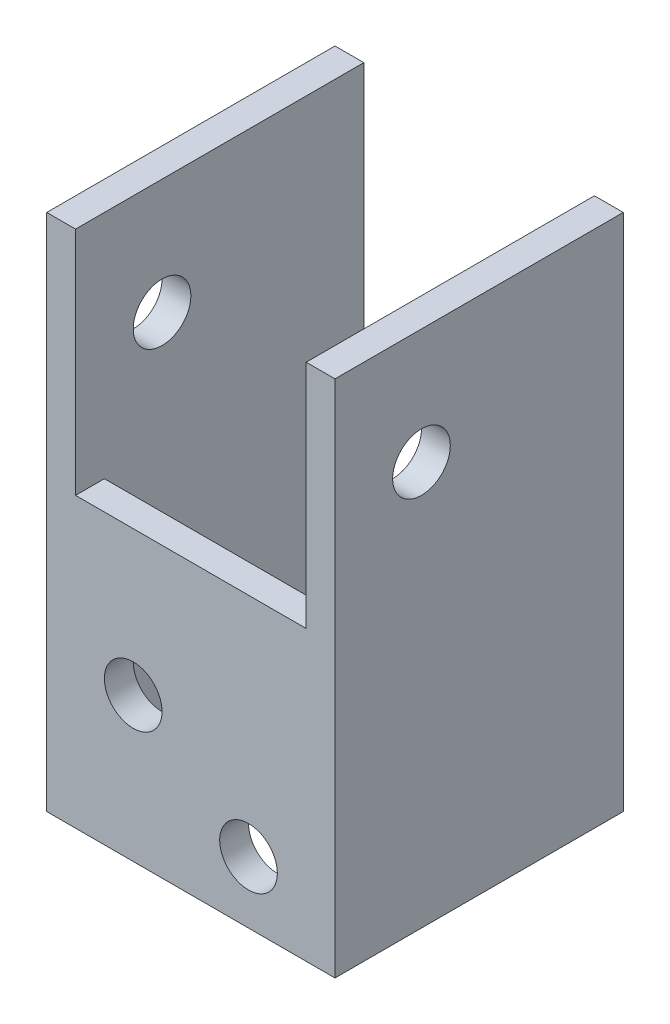
ISO-10303-21;
HEADER;
FILE_DESCRIPTION(('STEP AP214'),'2;1');
FILE_NAME('part.step','',(''),(''),'','','');
FILE_SCHEMA(('AUTOMOTIVE_DESIGN { 1 0 10303 214 1 1 1 1 }'));
ENDSEC;
DATA;
#1=APPLICATION_CONTEXT('core data for automotive mechanical design processes');
#2=APPLICATION_PROTOCOL_DEFINITION('international standard','automotive_design',2000,#1);
#3=PRODUCT_CONTEXT('',#1,'mechanical');
#4=PRODUCT('Part','Part','',(#3));
#5=PRODUCT_RELATED_PRODUCT_CATEGORY('part','',(#4));
#6=PRODUCT_DEFINITION_FORMATION('','',#4);
#7=PRODUCT_DEFINITION_CONTEXT('part definition',#1,'design');
#8=PRODUCT_DEFINITION('design','',#6,#7);
#9=PRODUCT_DEFINITION_SHAPE('','',#8);
#10=(LENGTH_UNIT() NAMED_UNIT(*) SI_UNIT(.MILLI.,.METRE.));
#11=(NAMED_UNIT(*) PLANE_ANGLE_UNIT() SI_UNIT($,.RADIAN.));
#12=(NAMED_UNIT(*) SI_UNIT($,.STERADIAN.) SOLID_ANGLE_UNIT());
#13=UNCERTAINTY_MEASURE_WITH_UNIT(LENGTH_MEASURE(1.E-05),#10,'distance_accuracy_value','');
#14=(GEOMETRIC_REPRESENTATION_CONTEXT(3) GLOBAL_UNCERTAINTY_ASSIGNED_CONTEXT((#13)) GLOBAL_UNIT_ASSIGNED_CONTEXT((#10,
#11,#12)) REPRESENTATION_CONTEXT('',''));
#15=CARTESIAN_POINT('',(0.,0.,0.));
#16=DIRECTION('',(0.,0.,1.));
#17=DIRECTION('',(1.,0.,0.));
#18=AXIS2_PLACEMENT_3D('',#15,#16,#17);
#19=CARTESIAN_POINT('',(0.,57.15,0.));
#20=DIRECTION('',(0.,-1.,0.));
#21=DIRECTION('',(0.,0.,-1.));
#22=AXIS2_PLACEMENT_3D('',#19,#20,#21);
#23=PLANE('',#22);
#24=DIRECTION('',(0.,0.,-1.));
#25=VECTOR('',#24,1.);
#26=CARTESIAN_POINT('',(28.575,57.15,-3.175));
#27=LINE('',#26,#25);
#28=CARTESIAN_POINT('',(28.575,57.15,0.));
#29=VERTEX_POINT('',#28);
#30=CARTESIAN_POINT('',(28.575,57.15,-31.75));
#31=VERTEX_POINT('',#30);
#32=EDGE_CURVE('E124',#29,#31,#27,.T.);
#33=ORIENTED_EDGE('',*,*,#32,.F.);
#34=DIRECTION('',(1.,0.,0.));
#35=VECTOR('',#34,1.);
#36=CARTESIAN_POINT('',(0.,57.15,0.));
#37=LINE('',#36,#35);
#38=CARTESIAN_POINT('',(31.75,57.15,0.));
#39=VERTEX_POINT('',#38);
#40=EDGE_CURVE('E127',#29,#39,#37,.T.);
#41=ORIENTED_EDGE('',*,*,#40,.T.);
#42=DIRECTION('',(0.,0.,-1.));
#43=VECTOR('',#42,1.);
#44=CARTESIAN_POINT('',(31.75,57.15,0.));
#45=LINE('',#44,#43);
#46=CARTESIAN_POINT('',(31.75,57.15,-31.75));
#47=VERTEX_POINT('',#46);
#48=EDGE_CURVE('E155',#39,#47,#45,.T.);
#49=ORIENTED_EDGE('',*,*,#48,.T.);
#50=DIRECTION('',(-1.,0.,0.));
#51=VECTOR('',#50,1.);
#52=CARTESIAN_POINT('',(0.,57.15,-31.75));
#53=LINE('',#52,#51);
#54=EDGE_CURVE('E130',#47,#31,#53,.T.);
#55=ORIENTED_EDGE('',*,*,#54,.T.);
#56=EDGE_LOOP('',(#33,#41,#49,#55));
#57=FACE_BOUND('',#56,.T.);
#58=ADVANCED_FACE('F47',(#57),#23,.F.);
#59=CARTESIAN_POINT('',(0.,57.15,-31.75));
#60=DIRECTION('',(0.,0.,1.));
#61=DIRECTION('',(1.,0.,0.));
#62=AXIS2_PLACEMENT_3D('',#59,#60,#61);
#63=PLANE('',#62);
#64=DIRECTION('',(-1.,0.,0.));
#65=VECTOR('',#64,1.);
#66=CARTESIAN_POINT('',(0.,0.,-31.75));
#67=LINE('',#66,#65);
#68=CARTESIAN_POINT('',(31.75,0.,-31.75));
#69=VERTEX_POINT('',#68);
#70=CARTESIAN_POINT('',(28.575,0.,-31.75));
#71=VERTEX_POINT('',#70);
#72=EDGE_CURVE('E157',#69,#71,#67,.T.);
#73=ORIENTED_EDGE('',*,*,#72,.T.);
#74=DIRECTION('',(0.,-1.,0.));
#75=VECTOR('',#74,1.);
#76=CARTESIAN_POINT('',(28.575,0.,-31.75));
#77=LINE('',#76,#75);
#78=EDGE_CURVE('E188',#31,#71,#77,.T.);
#79=ORIENTED_EDGE('',*,*,#78,.F.);
#80=ORIENTED_EDGE('',*,*,#54,.F.);
#81=DIRECTION('',(0.,-1.,0.));
#82=VECTOR('',#81,1.);
#83=CARTESIAN_POINT('',(31.75,57.15,-31.75));
#84=LINE('',#83,#82);
#85=EDGE_CURVE('E178',#47,#69,#84,.T.);
#86=ORIENTED_EDGE('',*,*,#85,.T.);
#87=EDGE_LOOP('',(#73,#79,#80,#86));
#88=FACE_BOUND('',#87,.T.);
#89=ADVANCED_FACE('F267',(#88),#63,.F.);
#90=CARTESIAN_POINT('',(0.,57.15,0.));
#91=VERTEX_POINT('',#90);
#92=CARTESIAN_POINT('',(3.175,57.15,0.));
#93=VERTEX_POINT('',#92);
#94=EDGE_CURVE('E151',#91,#93,#37,.T.);
#95=ORIENTED_EDGE('',*,*,#94,.T.);
#96=DIRECTION('',(0.,0.,1.));
#97=VECTOR('',#96,1.);
#98=CARTESIAN_POINT('',(3.175,57.15,-3.175));
#99=LINE('',#98,#97);
#100=CARTESIAN_POINT('',(3.175,57.15,-31.75));
#101=VERTEX_POINT('',#100);
#102=EDGE_CURVE('E134',#101,#93,#99,.T.);
#103=ORIENTED_EDGE('',*,*,#102,.F.);
#104=CARTESIAN_POINT('',(0.,57.15,-31.75));
#105=VERTEX_POINT('',#104);
#106=EDGE_CURVE('E162',#101,#105,#53,.T.);
#107=ORIENTED_EDGE('',*,*,#106,.T.);
#108=DIRECTION('',(0.,0.,1.));
#109=VECTOR('',#108,1.);
#110=CARTESIAN_POINT('',(0.,57.15,0.));
#111=LINE('',#110,#109);
#112=EDGE_CURVE('E152',#105,#91,#111,.T.);
#113=ORIENTED_EDGE('',*,*,#112,.T.);
#114=EDGE_LOOP('',(#95,#103,#107,#113));
#115=FACE_BOUND('',#114,.T.);
#116=ADVANCED_FACE('F240',(#115),#23,.F.);
#117=CARTESIAN_POINT('',(0.,0.,0.));
#118=DIRECTION('',(0.,-1.,0.));
#119=DIRECTION('',(0.,0.,-1.));
#120=AXIS2_PLACEMENT_3D('',#117,#118,#119);
#121=PLANE('',#120);
#122=DIRECTION('',(0.,0.,-1.));
#123=VECTOR('',#122,1.);
#124=CARTESIAN_POINT('',(28.575,0.,-3.175));
#125=LINE('',#124,#123);
#126=CARTESIAN_POINT('',(28.575,0.,-3.175));
#127=VERTEX_POINT('',#126);
#128=EDGE_CURVE('E216',#127,#71,#125,.T.);
#129=ORIENTED_EDGE('',*,*,#128,.T.);
#130=ORIENTED_EDGE('',*,*,#72,.F.);
#131=DIRECTION('',(0.,0.,-1.));
#132=VECTOR('',#131,1.);
#133=CARTESIAN_POINT('',(31.75,0.,0.));
#134=LINE('',#133,#132);
#135=CARTESIAN_POINT('',(31.75,0.,0.));
#136=VERTEX_POINT('',#135);
#137=EDGE_CURVE('E171',#136,#69,#134,.T.);
#138=ORIENTED_EDGE('',*,*,#137,.F.);
#139=DIRECTION('',(1.,0.,0.));
#140=VECTOR('',#139,1.);
#141=CARTESIAN_POINT('',(0.,0.,0.));
#142=LINE('',#141,#140);
#143=CARTESIAN_POINT('',(0.,0.,0.));
#144=VERTEX_POINT('',#143);
#145=EDGE_CURVE('E168',#144,#136,#142,.T.);
#146=ORIENTED_EDGE('',*,*,#145,.F.);
#147=DIRECTION('',(0.,0.,1.));
#148=VECTOR('',#147,1.);
#149=CARTESIAN_POINT('',(0.,0.,0.));
#150=LINE('',#149,#148);
#151=CARTESIAN_POINT('',(0.,0.,-31.75));
#152=VERTEX_POINT('',#151);
#153=EDGE_CURVE('E165',#152,#144,#150,.T.);
#154=ORIENTED_EDGE('',*,*,#153,.F.);
#155=CARTESIAN_POINT('',(3.17499999999999,0.,-31.75));
#156=VERTEX_POINT('',#155);
#157=EDGE_CURVE('E173',#156,#152,#67,.T.);
#158=ORIENTED_EDGE('',*,*,#157,.F.);
#159=DIRECTION('',(0.,0.,1.));
#160=VECTOR('',#159,1.);
#161=CARTESIAN_POINT('',(3.175,0.,-3.175));
#162=LINE('',#161,#160);
#163=CARTESIAN_POINT('',(3.175,0.,-3.175));
#164=VERTEX_POINT('',#163);
#165=EDGE_CURVE('E135',#156,#164,#162,.T.);
#166=ORIENTED_EDGE('',*,*,#165,.T.);
#167=DIRECTION('',(1.,0.,0.));
#168=VECTOR('',#167,1.);
#169=CARTESIAN_POINT('',(3.175,0.,-3.175));
#170=LINE('',#169,#168);
#171=EDGE_CURVE('E211',#164,#127,#170,.T.);
#172=ORIENTED_EDGE('',*,*,#171,.T.);
#173=EDGE_LOOP('',(#129,#130,#138,#146,#154,#158,#166,#172));
#174=FACE_BOUND('',#173,.T.);
#175=ADVANCED_FACE('F228',(#174),#121,.T.);
#176=CARTESIAN_POINT('',(0.,57.15,0.));
#177=DIRECTION('',(1.,0.,0.));
#178=DIRECTION('',(0.,0.,-1.));
#179=AXIS2_PLACEMENT_3D('',#176,#177,#178);
#180=PLANE('',#179);
#181=CARTESIAN_POINT('',(0.,44.45,-9.525));
#182=DIRECTION('',(1.,0.,0.));
#183=DIRECTION('',(0.,0.,-1.));
#184=AXIS2_PLACEMENT_3D('',#181,#182,#183);
#185=CIRCLE('',#184,3.17499999999999);
#186=CARTESIAN_POINT('',(0.,44.45,-12.7));
#187=VERTEX_POINT('',#186);
#188=EDGE_CURVE('E185',#187,#187,#185,.T.);
#189=ORIENTED_EDGE('',*,*,#188,.T.);
#190=EDGE_LOOP('',(#189));
#191=FACE_BOUND('',#190,.T.);
#192=ORIENTED_EDGE('',*,*,#153,.T.);
#193=DIRECTION('',(0.,-1.,0.));
#194=VECTOR('',#193,1.);
#195=CARTESIAN_POINT('',(0.,57.15,0.));
#196=LINE('',#195,#194);
#197=EDGE_CURVE('E11',#91,#144,#196,.T.);
#198=ORIENTED_EDGE('',*,*,#197,.F.);
#199=ORIENTED_EDGE('',*,*,#112,.F.);
#200=DIRECTION('',(0.,-1.,0.));
#201=VECTOR('',#200,1.);
#202=CARTESIAN_POINT('',(0.,57.15,-31.75));
#203=LINE('',#202,#201);
#204=EDGE_CURVE('E164',#105,#152,#203,.T.);
#205=ORIENTED_EDGE('',*,*,#204,.T.);
#206=EDGE_LOOP('',(#192,#198,#199,#205));
#207=FACE_BOUND('',#206,.T.);
#208=ADVANCED_FACE('F49',(#191,#207),#180,.F.);
#209=CARTESIAN_POINT('',(0.,57.15,0.));
#210=DIRECTION('',(0.,0.,-1.));
#211=DIRECTION('',(-1.,0.,0.));
#212=AXIS2_PLACEMENT_3D('',#209,#210,#211);
#213=PLANE('',#212);
#214=CARTESIAN_POINT('',(22.225,6.80357142857142,0.));
#215=DIRECTION('',(0.,0.,1.));
#216=DIRECTION('',(1.,0.,0.));
#217=AXIS2_PLACEMENT_3D('',#214,#215,#216);
#218=CIRCLE('',#217,3.175);
#219=CARTESIAN_POINT('',(25.4,6.80357142857142,0.));
#220=VERTEX_POINT('',#219);
#221=EDGE_CURVE('E199',#220,#220,#218,.T.);
#222=ORIENTED_EDGE('',*,*,#221,.F.);
#223=EDGE_LOOP('',(#222));
#224=FACE_BOUND('',#223,.T.);
#225=CARTESIAN_POINT('',(9.525,15.875,0.));
#226=DIRECTION('',(0.,0.,1.));
#227=DIRECTION('',(1.,0.,0.));
#228=AXIS2_PLACEMENT_3D('',#225,#226,#227);
#229=CIRCLE('',#228,3.175);
#230=CARTESIAN_POINT('',(12.7,15.875,0.));
#231=VERTEX_POINT('',#230);
#232=EDGE_CURVE('E189',#231,#231,#229,.T.);
#233=ORIENTED_EDGE('',*,*,#232,.F.);
#234=EDGE_LOOP('',(#233));
#235=FACE_BOUND('',#234,.T.);
#236=ORIENTED_EDGE('',*,*,#40,.F.);
#237=DIRECTION('',(0.,1.,0.));
#238=VECTOR('',#237,1.);
#239=CARTESIAN_POINT('',(28.575,57.15,0.));
#240=LINE('',#239,#238);
#241=CARTESIAN_POINT('',(28.575,31.75,0.));
#242=VERTEX_POINT('',#241);
#243=EDGE_CURVE('E138',#242,#29,#240,.T.);
#244=ORIENTED_EDGE('',*,*,#243,.F.);
#245=DIRECTION('',(1.,0.,0.));
#246=VECTOR('',#245,1.);
#247=CARTESIAN_POINT('',(28.575,31.75,0.));
#248=LINE('',#247,#246);
#249=CARTESIAN_POINT('',(3.175,31.75,0.));
#250=VERTEX_POINT('',#249);
#251=EDGE_CURVE('E243',#250,#242,#248,.T.);
#252=ORIENTED_EDGE('',*,*,#251,.F.);
#253=DIRECTION('',(0.,-1.,0.));
#254=VECTOR('',#253,1.);
#255=CARTESIAN_POINT('',(3.175,31.75,0.));
#256=LINE('',#255,#254);
#257=EDGE_CURVE('E146',#93,#250,#256,.T.);
#258=ORIENTED_EDGE('',*,*,#257,.F.);
#259=ORIENTED_EDGE('',*,*,#94,.F.);
#260=ORIENTED_EDGE('',*,*,#197,.T.);
#261=ORIENTED_EDGE('',*,*,#145,.T.);
#262=DIRECTION('',(0.,-1.,0.));
#263=VECTOR('',#262,1.);
#264=CARTESIAN_POINT('',(31.75,57.15,0.));
#265=LINE('',#264,#263);
#266=EDGE_CURVE('E56',#39,#136,#265,.T.);
#267=ORIENTED_EDGE('',*,*,#266,.F.);
#268=EDGE_LOOP('',(#236,#244,#252,#258,#259,#260,#261,#267));
#269=FACE_BOUND('',#268,.T.);
#270=ADVANCED_FACE('F148',(#224,#235,#269),#213,.F.);
#271=CARTESIAN_POINT('',(31.75,57.15,0.));
#272=DIRECTION('',(-1.,0.,0.));
#273=DIRECTION('',(0.,0.,1.));
#274=AXIS2_PLACEMENT_3D('',#271,#272,#273);
#275=PLANE('',#274);
#276=CARTESIAN_POINT('',(31.75,44.45,-9.525));
#277=DIRECTION('',(1.,0.,0.));
#278=DIRECTION('',(0.,0.,-1.));
#279=AXIS2_PLACEMENT_3D('',#276,#277,#278);
#280=CIRCLE('',#279,3.175);
#281=CARTESIAN_POINT('',(31.75,44.45,-12.7));
#282=VERTEX_POINT('',#281);
#283=EDGE_CURVE('E205',#282,#282,#280,.T.);
#284=ORIENTED_EDGE('',*,*,#283,.F.);
#285=EDGE_LOOP('',(#284));
#286=FACE_BOUND('',#285,.T.);
#287=ORIENTED_EDGE('',*,*,#137,.T.);
#288=ORIENTED_EDGE('',*,*,#85,.F.);
#289=ORIENTED_EDGE('',*,*,#48,.F.);
#290=ORIENTED_EDGE('',*,*,#266,.T.);
#291=EDGE_LOOP('',(#287,#288,#289,#290));
#292=FACE_BOUND('',#291,.T.);
#293=ADVANCED_FACE('F256',(#286,#292),#275,.F.);
#294=ORIENTED_EDGE('',*,*,#106,.F.);
#295=DIRECTION('',(0.,1.,0.));
#296=VECTOR('',#295,1.);
#297=CARTESIAN_POINT('',(3.175,57.15,-31.75));
#298=LINE('',#297,#296);
#299=EDGE_CURVE('E192',#156,#101,#298,.T.);
#300=ORIENTED_EDGE('',*,*,#299,.F.);
#301=ORIENTED_EDGE('',*,*,#157,.T.);
#302=ORIENTED_EDGE('',*,*,#204,.F.);
#303=EDGE_LOOP('',(#294,#300,#301,#302));
#304=FACE_BOUND('',#303,.T.);
#305=ADVANCED_FACE('F236',(#304),#63,.F.);
#306=CARTESIAN_POINT('',(3.175,57.15,-3.175));
#307=DIRECTION('',(0.,0.,-1.));
#308=DIRECTION('',(-1.,0.,0.));
#309=AXIS2_PLACEMENT_3D('',#306,#307,#308);
#310=PLANE('',#309);
#311=DIRECTION('',(-1.,0.,0.));
#312=VECTOR('',#311,1.);
#313=CARTESIAN_POINT('',(3.175,31.75,-3.175));
#314=LINE('',#313,#312);
#315=CARTESIAN_POINT('',(28.575,31.75,-3.175));
#316=VERTEX_POINT('',#315);
#317=CARTESIAN_POINT('',(3.175,31.75,-3.175));
#318=VERTEX_POINT('',#317);
#319=EDGE_CURVE('E225',#316,#318,#314,.T.);
#320=ORIENTED_EDGE('',*,*,#319,.F.);
#321=DIRECTION('',(0.,-1.,0.));
#322=VECTOR('',#321,1.);
#323=CARTESIAN_POINT('',(28.575,57.15,-3.175));
#324=LINE('',#323,#322);
#325=EDGE_CURVE('E169',#316,#127,#324,.T.);
#326=ORIENTED_EDGE('',*,*,#325,.T.);
#327=ORIENTED_EDGE('',*,*,#171,.F.);
#328=DIRECTION('',(0.,-1.,0.));
#329=VECTOR('',#328,1.);
#330=CARTESIAN_POINT('',(3.175,57.15,-3.175));
#331=LINE('',#330,#329);
#332=EDGE_CURVE('E69',#318,#164,#331,.T.);
#333=ORIENTED_EDGE('',*,*,#332,.F.);
#334=EDGE_LOOP('',(#320,#326,#327,#333));
#335=FACE_BOUND('',#334,.T.);
#336=CARTESIAN_POINT('',(22.225,6.80357142857142,-3.175));
#337=DIRECTION('',(0.,0.,-1.));
#338=DIRECTION('',(-1.,0.,0.));
#339=AXIS2_PLACEMENT_3D('',#336,#337,#338);
#340=CIRCLE('',#339,3.17499999999999);
#341=CARTESIAN_POINT('',(19.05,6.80357142857142,-3.175));
#342=VERTEX_POINT('',#341);
#343=EDGE_CURVE('E51',#342,#342,#340,.T.);
#344=ORIENTED_EDGE('',*,*,#343,.F.);
#345=EDGE_LOOP('',(#344));
#346=FACE_BOUND('',#345,.T.);
#347=CARTESIAN_POINT('',(9.525,15.875,-3.175));
#348=DIRECTION('',(0.,0.,-1.));
#349=DIRECTION('',(-1.,0.,0.));
#350=AXIS2_PLACEMENT_3D('',#347,#348,#349);
#351=CIRCLE('',#350,3.17499999999999);
#352=CARTESIAN_POINT('',(6.35000000000001,15.875,-3.175));
#353=VERTEX_POINT('',#352);
#354=EDGE_CURVE('E186',#353,#353,#351,.T.);
#355=ORIENTED_EDGE('',*,*,#354,.F.);
#356=EDGE_LOOP('',(#355));
#357=FACE_BOUND('',#356,.T.);
#358=ADVANCED_FACE('F223',(#335,#346,#357),#310,.T.);
#359=CARTESIAN_POINT('',(28.575,57.15,-3.175));
#360=DIRECTION('',(-1.,0.,0.));
#361=DIRECTION('',(0.,0.,1.));
#362=AXIS2_PLACEMENT_3D('',#359,#360,#361);
#363=PLANE('',#362);
#364=ORIENTED_EDGE('',*,*,#325,.F.);
#365=DIRECTION('',(0.,0.,1.));
#366=VECTOR('',#365,1.);
#367=CARTESIAN_POINT('',(28.575,31.75,-5.08));
#368=LINE('',#367,#366);
#369=EDGE_CURVE('E142',#316,#242,#368,.T.);
#370=ORIENTED_EDGE('',*,*,#369,.T.);
#371=ORIENTED_EDGE('',*,*,#243,.T.);
#372=ORIENTED_EDGE('',*,*,#32,.T.);
#373=ORIENTED_EDGE('',*,*,#78,.T.);
#374=ORIENTED_EDGE('',*,*,#128,.F.);
#375=EDGE_LOOP('',(#364,#370,#371,#372,#373,#374));
#376=FACE_BOUND('',#375,.T.);
#377=CARTESIAN_POINT('',(28.575,44.45,-9.525));
#378=DIRECTION('',(-1.,0.,0.));
#379=DIRECTION('',(0.,0.,1.));
#380=AXIS2_PLACEMENT_3D('',#377,#378,#379);
#381=CIRCLE('',#380,3.17499999999999);
#382=CARTESIAN_POINT('',(28.575,44.45,-6.35));
#383=VERTEX_POINT('',#382);
#384=EDGE_CURVE('E184',#383,#383,#381,.T.);
#385=ORIENTED_EDGE('',*,*,#384,.F.);
#386=EDGE_LOOP('',(#385));
#387=FACE_BOUND('',#386,.T.);
#388=ADVANCED_FACE('F140',(#376,#387),#363,.T.);
#389=CARTESIAN_POINT('',(3.175,57.15,-3.175));
#390=DIRECTION('',(1.,0.,0.));
#391=DIRECTION('',(0.,0.,-1.));
#392=AXIS2_PLACEMENT_3D('',#389,#390,#391);
#393=PLANE('',#392);
#394=ORIENTED_EDGE('',*,*,#102,.T.);
#395=ORIENTED_EDGE('',*,*,#257,.T.);
#396=DIRECTION('',(0.,0.,1.));
#397=VECTOR('',#396,1.);
#398=CARTESIAN_POINT('',(3.175,31.75,-5.08));
#399=LINE('',#398,#397);
#400=EDGE_CURVE('E64',#318,#250,#399,.T.);
#401=ORIENTED_EDGE('',*,*,#400,.F.);
#402=ORIENTED_EDGE('',*,*,#332,.T.);
#403=ORIENTED_EDGE('',*,*,#165,.F.);
#404=ORIENTED_EDGE('',*,*,#299,.T.);
#405=EDGE_LOOP('',(#394,#395,#401,#402,#403,#404));
#406=FACE_BOUND('',#405,.T.);
#407=CARTESIAN_POINT('',(3.175,44.45,-9.525));
#408=DIRECTION('',(1.,0.,0.));
#409=DIRECTION('',(0.,0.,-1.));
#410=AXIS2_PLACEMENT_3D('',#407,#408,#409);
#411=CIRCLE('',#410,3.17499999999999);
#412=CARTESIAN_POINT('',(3.175,44.45,-12.7));
#413=VERTEX_POINT('',#412);
#414=EDGE_CURVE('E182',#413,#413,#411,.T.);
#415=ORIENTED_EDGE('',*,*,#414,.F.);
#416=EDGE_LOOP('',(#415));
#417=FACE_BOUND('',#416,.T.);
#418=ADVANCED_FACE('F232',(#406,#417),#393,.T.);
#419=CARTESIAN_POINT('',(31.75,44.45,-9.525));
#420=DIRECTION('',(1.,0.,0.));
#421=DIRECTION('',(0.,0.,-1.));
#422=AXIS2_PLACEMENT_3D('',#419,#420,#421);
#423=CYLINDRICAL_SURFACE('',#422,3.17499999999999);
#424=ORIENTED_EDGE('',*,*,#414,.T.);
#425=EDGE_LOOP('',(#424));
#426=FACE_BOUND('',#425,.T.);
#427=ORIENTED_EDGE('',*,*,#188,.F.);
#428=EDGE_LOOP('',(#427));
#429=FACE_BOUND('',#428,.T.);
#430=ADVANCED_FACE('F293',(#426,#429),#423,.F.);
#431=ORIENTED_EDGE('',*,*,#384,.T.);
#432=EDGE_LOOP('',(#431));
#433=FACE_BOUND('',#432,.T.);
#434=ORIENTED_EDGE('',*,*,#283,.T.);
#435=EDGE_LOOP('',(#434));
#436=FACE_BOUND('',#435,.T.);
#437=ADVANCED_FACE('F296',(#433,#436),#423,.F.);
#438=CARTESIAN_POINT('',(9.525,15.875,0.));
#439=DIRECTION('',(0.,0.,1.));
#440=DIRECTION('',(1.,0.,0.));
#441=AXIS2_PLACEMENT_3D('',#438,#439,#440);
#442=CYLINDRICAL_SURFACE('',#441,3.17499999999999);
#443=ORIENTED_EDGE('',*,*,#354,.T.);
#444=EDGE_LOOP('',(#443));
#445=FACE_BOUND('',#444,.T.);
#446=ORIENTED_EDGE('',*,*,#232,.T.);
#447=EDGE_LOOP('',(#446));
#448=FACE_BOUND('',#447,.T.);
#449=ADVANCED_FACE('F298',(#445,#448),#442,.F.);
#450=CARTESIAN_POINT('',(22.225,6.80357142857142,0.));
#451=DIRECTION('',(0.,0.,1.));
#452=DIRECTION('',(1.,0.,0.));
#453=AXIS2_PLACEMENT_3D('',#450,#451,#452);
#454=CYLINDRICAL_SURFACE('',#453,3.17499999999999);
#455=ORIENTED_EDGE('',*,*,#343,.T.);
#456=EDGE_LOOP('',(#455));
#457=FACE_BOUND('',#456,.T.);
#458=ORIENTED_EDGE('',*,*,#221,.T.);
#459=EDGE_LOOP('',(#458));
#460=FACE_BOUND('',#459,.T.);
#461=ADVANCED_FACE('F252',(#457,#460),#454,.F.);
#462=CARTESIAN_POINT('',(28.575,31.75,-5.08));
#463=DIRECTION('',(0.,-1.,0.));
#464=DIRECTION('',(0.,0.,-1.));
#465=AXIS2_PLACEMENT_3D('',#462,#463,#464);
#466=PLANE('',#465);
#467=ORIENTED_EDGE('',*,*,#319,.T.);
#468=ORIENTED_EDGE('',*,*,#400,.T.);
#469=ORIENTED_EDGE('',*,*,#251,.T.);
#470=ORIENTED_EDGE('',*,*,#369,.F.);
#471=EDGE_LOOP('',(#467,#468,#469,#470));
#472=FACE_BOUND('',#471,.T.);
#473=ADVANCED_FACE('F303',(#472),#466,.F.);
#474=CLOSED_SHELL('',(#58,#89,#116,#175,#208,#270,#293,#305,#358,#388,#418,#430,#437,#449,#461,#473));
#475=MANIFOLD_SOLID_BREP('B2',#474);
#476=ADVANCED_BREP_SHAPE_REPRESENTATION('',(#18,#475),#14);
#477=SHAPE_DEFINITION_REPRESENTATION(#9,#476);
ENDSEC;
END-ISO-10303-21;
